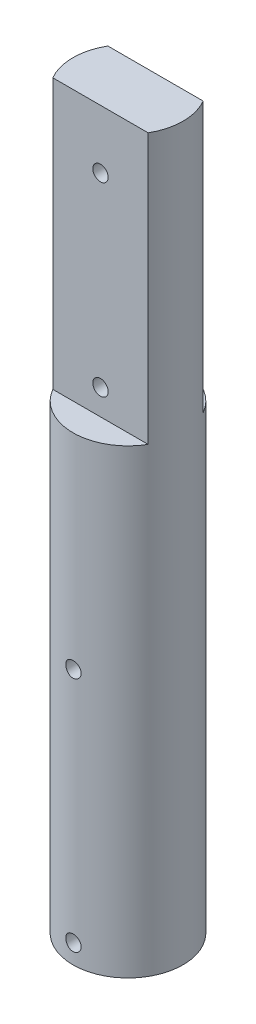
ISO-10303-21;
HEADER;
FILE_DESCRIPTION(('STEP AP214'),'2;1');
FILE_NAME('part.step','',(''),(''),'','','');
FILE_SCHEMA(('AUTOMOTIVE_DESIGN { 1 0 10303 214 1 1 1 1 }'));
ENDSEC;
DATA;
#1=APPLICATION_CONTEXT('core data for automotive mechanical design processes');
#2=APPLICATION_PROTOCOL_DEFINITION('international standard','automotive_design',2000,#1);
#3=PRODUCT_CONTEXT('',#1,'mechanical');
#4=PRODUCT('Part','Part','',(#3));
#5=PRODUCT_RELATED_PRODUCT_CATEGORY('part','',(#4));
#6=PRODUCT_DEFINITION_FORMATION('','',#4);
#7=PRODUCT_DEFINITION_CONTEXT('part definition',#1,'design');
#8=PRODUCT_DEFINITION('design','',#6,#7);
#9=PRODUCT_DEFINITION_SHAPE('','',#8);
#10=(LENGTH_UNIT() NAMED_UNIT(*) SI_UNIT(.MILLI.,.METRE.));
#11=(NAMED_UNIT(*) PLANE_ANGLE_UNIT() SI_UNIT($,.RADIAN.));
#12=(NAMED_UNIT(*) SI_UNIT($,.STERADIAN.) SOLID_ANGLE_UNIT());
#13=UNCERTAINTY_MEASURE_WITH_UNIT(LENGTH_MEASURE(1.E-05),#10,'distance_accuracy_value','');
#14=(GEOMETRIC_REPRESENTATION_CONTEXT(3) GLOBAL_UNCERTAINTY_ASSIGNED_CONTEXT((#13)) GLOBAL_UNIT_ASSIGNED_CONTEXT((#10,
#11,#12)) REPRESENTATION_CONTEXT('',''));
#15=CARTESIAN_POINT('',(0.,0.,0.));
#16=DIRECTION('',(0.,0.,1.));
#17=DIRECTION('',(1.,0.,0.));
#18=AXIS2_PLACEMENT_3D('',#15,#16,#17);
#19=CARTESIAN_POINT('',(0.,57.08,0.));
#20=DIRECTION('',(0.,-1.,0.));
#21=DIRECTION('',(0.,0.,-1.));
#22=AXIS2_PLACEMENT_3D('',#19,#20,#21);
#23=CYLINDRICAL_SURFACE('',#22,4.3);
#24=CARTESIAN_POINT('',(0.,20.6,-4.3));
#25=CARTESIAN_POINT('',(-0.0335275708954897,20.5999985978478,-4.29999948998828));
#26=CARTESIAN_POINT('',(-0.0670752568055947,20.5971802725972,-4.29960374919141));
#27=CARTESIAN_POINT('',(-0.133234765094414,20.5859832404072,-4.29806313788312));
#28=CARTESIAN_POINT('',(-0.165845612787704,20.5775989466993,-4.29691751470318));
#29=CARTESIAN_POINT('',(-0.229164259589988,20.5555238188583,-4.29400602126612));
#30=CARTESIAN_POINT('',(-0.259873409722147,20.5418368032867,-4.29224059742145));
#31=CARTESIAN_POINT('',(-0.318553827917283,20.5095536716102,-4.2882851399914));
#32=CARTESIAN_POINT('',(-0.346525514468045,20.4909583074777,-4.28609517146105));
#33=CARTESIAN_POINT('',(-0.399132362654932,20.4492514408053,-4.28151793661773));
#34=CARTESIAN_POINT('',(-0.423746219246013,20.4261131850964,-4.27912955238765));
#35=CARTESIAN_POINT('',(-0.468755033022216,20.3760348777371,-4.27443353651476));
#36=CARTESIAN_POINT('',(-0.489149760154739,20.349094618913,-4.27212590928101));
#37=CARTESIAN_POINT('',(-0.525222813862831,20.2920358674213,-4.26784178957295));
#38=CARTESIAN_POINT('',(-0.540880803565907,20.2619043998434,-4.26586674063646));
#39=CARTESIAN_POINT('',(-0.566905987390073,20.1994072364682,-4.26248646659039));
#40=CARTESIAN_POINT('',(-0.577273430901677,20.1670416460666,-4.26108121462185));
#41=CARTESIAN_POINT('',(-0.592357659935901,20.1012178549024,-4.25901051645618));
#42=CARTESIAN_POINT('',(-0.597110717131838,20.067768118182,-4.2583403234546));
#43=CARTESIAN_POINT('',(-0.600943561766013,20.000539603382,-4.25780117064252));
#44=CARTESIAN_POINT('',(-0.600023631787931,19.9667608417756,-4.25793217092285));
#45=CARTESIAN_POINT('',(-0.592566315008618,19.9000878341174,-4.25897626031051));
#46=CARTESIAN_POINT('',(-0.58606912945851,19.8671889913896,-4.25988375226073));
#47=CARTESIAN_POINT('',(-0.567704572579319,19.802953093001,-4.26236983738622));
#48=CARTESIAN_POINT('',(-0.555837068176973,19.7716160760626,-4.26394844719133));
#49=CARTESIAN_POINT('',(-0.527026323626944,19.7112699248211,-4.26760515516274));
#50=CARTESIAN_POINT('',(-0.510065861498755,19.6822691193085,-4.2696849432885));
#51=CARTESIAN_POINT('',(-0.471562935270108,19.6275099701351,-4.27410841247884));
#52=CARTESIAN_POINT('',(-0.450020210459266,19.6017518110992,-4.27645210855503));
#53=CARTESIAN_POINT('',(-0.402742670041643,19.5539759864553,-4.28116411843535));
#54=CARTESIAN_POINT('',(-0.376973251465277,19.5319925521903,-4.28353247001617));
#55=CARTESIAN_POINT('',(-0.322092287159643,19.4926575758627,-4.28800807840038));
#56=CARTESIAN_POINT('',(-0.292980730134555,19.4753060494557,-4.29011533432126));
#57=CARTESIAN_POINT('',(-0.232213629625437,19.44572644193,-4.29383310935159));
#58=CARTESIAN_POINT('',(-0.200556892049325,19.4335007825673,-4.29544339356825));
#59=CARTESIAN_POINT('',(-0.135612264376522,19.4145485681921,-4.29798376319159));
#60=CARTESIAN_POINT('',(-0.102324469702198,19.4078216918883,-4.2989138883393));
#61=CARTESIAN_POINT('',(-0.0353583224519229,19.4001030056331,-4.29998392063015));
#62=CARTESIAN_POINT('',(-0.0016854987461861,19.3990640935691,-4.30013031761203));
#63=CARTESIAN_POINT('',(0.0653538297456075,19.4026261202611,-4.2996340014627));
#64=CARTESIAN_POINT('',(0.0987203426804362,19.4072269085437,-4.29899130938524));
#65=CARTESIAN_POINT('',(0.164058846929469,19.4218985824152,-4.29699305017726));
#66=CARTESIAN_POINT('',(0.196036041292867,19.4319467349736,-4.2956404464044));
#67=CARTESIAN_POINT('',(0.257851715539666,19.4572040834507,-4.29237363745077));
#68=CARTESIAN_POINT('',(0.287690106871594,19.4724134929082,-4.29045940903412));
#69=CARTESIAN_POINT('',(0.344589725167919,19.5076736387418,-4.28626620512982));
#70=CARTESIAN_POINT('',(0.37163210723284,19.527754514199,-4.28398498995698));
#71=CARTESIAN_POINT('',(0.421979686070999,19.5721453127426,-4.27931929765121));
#72=CARTESIAN_POINT('',(0.445284696155329,19.5964554469622,-4.27693481536744));
#73=CARTESIAN_POINT('',(0.487665504950374,19.6488234267959,-4.27231099718785));
#74=CARTESIAN_POINT('',(0.506709880716578,19.6769068202911,-4.27007282070155));
#75=CARTESIAN_POINT('',(0.539810994020146,19.7359015084936,-4.26601492837375));
#76=CARTESIAN_POINT('',(0.553867851571848,19.7668127351325,-4.26419520246346));
#77=CARTESIAN_POINT('',(0.576545242128528,19.8304885568759,-4.26118843893877));
#78=CARTESIAN_POINT('',(0.585182829287748,19.8632469806403,-4.25999941837257));
#79=CARTESIAN_POINT('',(0.596831068495092,19.9297671612301,-4.25838324196421));
#80=CARTESIAN_POINT('',(0.599842052660963,19.9635288587164,-4.25795604115468));
#81=CARTESIAN_POINT('',(0.600144507298716,20.0307842941412,-4.25791339524925));
#82=CARTESIAN_POINT('',(0.597485363562369,20.0642778161177,-4.25829094094571));
#83=CARTESIAN_POINT('',(0.58662832621675,20.1303365967041,-4.25980008766519));
#84=CARTESIAN_POINT('',(0.578430436973298,20.1629018560456,-4.26093168809384));
#85=CARTESIAN_POINT('',(0.556745207820723,20.2261691602408,-4.26381911509842));
#86=CARTESIAN_POINT('',(0.543260852083049,20.2568722450073,-4.26557458944993));
#87=CARTESIAN_POINT('',(0.511390326464101,20.3155881392943,-4.26951245715507));
#88=CARTESIAN_POINT('',(0.493004036126813,20.3436008826815,-4.27169486099936));
#89=CARTESIAN_POINT('',(0.4516703997109,20.3963925549525,-4.27626338760595));
#90=CARTESIAN_POINT('',(0.428686359899418,20.4211426233099,-4.27865105496591));
#91=CARTESIAN_POINT('',(0.378886995784174,20.4664525970426,-4.28334785151524));
#92=CARTESIAN_POINT('',(0.352070777188077,20.4870115216311,-4.28565696221616));
#93=CARTESIAN_POINT('',(0.295220169181282,20.5234410796524,-4.28994881478982));
#94=CARTESIAN_POINT('',(0.26517113814944,20.5392890451705,-4.29192995897052));
#95=CARTESIAN_POINT('',(0.202825627356861,20.5656901543197,-4.29532682280706));
#96=CARTESIAN_POINT('',(0.170531567358777,20.5762489010869,-4.29674314048629));
#97=CARTESIAN_POINT('',(0.115068757876271,20.5893179403315,-4.29851944143484));
#98=CARTESIAN_POINT('',(0.0922458092193602,20.5933177536102,-4.29907186458088));
#99=CARTESIAN_POINT('',(0.0462851008623458,20.5986592541178,-4.29981231808903));
#100=CARTESIAN_POINT('',(0.0231473443262198,20.6000009680421,-4.30000035211072));
#101=CARTESIAN_POINT('',(0.,20.6,-4.3));
#102=B_SPLINE_CURVE_WITH_KNOTS('',3,(#24,#25,#26,#27,#28,#29,#30,#31,#32,#33,#34,#35,#36,#37,
#38,#39,#40,#41,#42,#43,#44,#45,#46,#47,#48,#49,#50,#51,#52,#53,#54,#55,#56,#57,#58,#59,#60,#61,
#62,#63,#64,#65,#66,#67,#68,#69,#70,#71,#72,#73,#74,#75,#76,#77,#78,#79,#80,#81,#82,#83,#84,#85,
#86,#87,#88,#89,#90,#91,#92,#93,#94,#95,#96,#97,#98,#99,#100,#101),.UNSPECIFIED.,.T.,.F.,(4,2,2,
2,2,2,2,2,2,2,2,2,2,2,2,2,2,2,2,2,2,2,2,2,2,2,2,2,2,2,2,2,2,2,2,2,2,2,4),(0.,0.100498144631237,
0.201097315798383,0.30162417839486,0.402135648934119,0.50325781806992,0.604385499548968,
0.705941397439209,0.80749250765405,0.908383896114988,1.00927025899966,1.1094354742126,
1.20960317159513,1.31011347802753,1.41062950458006,1.51201376490475,1.61339836789992,
1.71483081701727,1.81625733906144,1.91684266169334,2.01742530065855,2.11759138192519,
2.21776160791049,2.31856812897261,2.41937968394664,2.52091187963721,2.6224416319992,
2.72365025159284,2.82485289702399,2.92517768800756,3.02550239991196,3.12577056060965,
3.22604118543983,3.32714649764197,3.42827544282475,3.5298833975973,3.63138348510181,
3.70076782935699,3.7701514767789),.UNSPECIFIED.);
#103=CARTESIAN_POINT('',(0.,20.6,-4.3));
#104=VERTEX_POINT('',#103);
#105=EDGE_CURVE('E11',#104,#104,#102,.T.);
#106=ORIENTED_EDGE('',*,*,#105,.T.);
#107=EDGE_LOOP('',(#106));
#108=FACE_BOUND('',#107,.T.);
#109=CARTESIAN_POINT('',(0.600000000000002,20.,4.25793377120875));
#110=CARTESIAN_POINT('',(0.599998596295425,19.9664742202909,4.25793430012104));
#111=CARTESIAN_POINT('',(0.597180562007332,19.9329283205578,4.25833401086069));
#112=CARTESIAN_POINT('',(0.585984790455614,19.8667725228749,4.25988879424771));
#113=CARTESIAN_POINT('',(0.577601460026841,19.8341636010267,4.26104462678624));
#114=CARTESIAN_POINT('',(0.555529149502572,19.7708490284595,4.26397824842413));
#115=CARTESIAN_POINT('',(0.541844033576981,19.7401420104136,4.26575558445328));
#116=CARTESIAN_POINT('',(0.509565376901617,19.6814651719407,4.26973141114822));
#117=CARTESIAN_POINT('',(0.490972583540943,19.6534949356181,4.27192983767227));
#118=CARTESIAN_POINT('',(0.449268326315554,19.6008864798205,4.27651721618567));
#119=CARTESIAN_POINT('',(0.426129533826407,19.5762700176842,4.27890726597518));
#120=CARTESIAN_POINT('',(0.376049054908141,19.531256166575,4.28359876394619));
#121=CARTESIAN_POINT('',(0.349107168457573,19.5108589996526,4.28590020745939));
#122=CARTESIAN_POINT('',(0.292046961153537,19.4747833707848,4.29016657082425));
#123=CARTESIAN_POINT('',(0.261915945421763,19.4591248041596,4.29213005727407));
#124=CARTESIAN_POINT('',(0.19941976311111,19.4330984294994,4.29548715382562));
#125=CARTESIAN_POINT('',(0.167054699129085,19.4227303786848,4.29688079007695));
#126=CARTESIAN_POINT('',(0.101232641053802,19.4076449158011,4.29893342127308));
#127=CARTESIAN_POINT('',(0.0677841244297408,19.4028911670605,4.29959713842488));
#128=CARTESIAN_POINT('',(0.000558007541838021,19.3990565164659,4.30013130804566));
#129=CARTESIAN_POINT('',(-0.0332195766999149,19.3999753397828,4.3000017989455));
#130=CARTESIAN_POINT('',(-0.0998974001463257,19.4074308803803,4.29896790198468));
#131=CARTESIAN_POINT('',(-0.132802105181253,19.4139285113459,4.2980689054519));
#132=CARTESIAN_POINT('',(-0.197049497264932,19.4322959817346,4.2956030641155));
#133=CARTESIAN_POINT('',(-0.228392148593683,19.444165943946,4.29403620404744));
#134=CARTESIAN_POINT('',(-0.288745223083573,19.4729818263627,4.29040139870199));
#135=CARTESIAN_POINT('',(-0.317747590654341,19.4899444032253,4.28833181344418));
#136=CARTESIAN_POINT('',(-0.372508971958374,19.5284518693034,4.28392260871992));
#137=CARTESIAN_POINT('',(-0.398267800480896,19.5499970200019,4.28158297384784));
#138=CARTESIAN_POINT('',(-0.446040975382723,19.5972763116646,4.27687148671639));
#139=CARTESIAN_POINT('',(-0.468021577451513,19.6230445527966,4.27449952974786));
#140=CARTESIAN_POINT('',(-0.507351396087956,19.6779221414956,4.27001026095443));
#141=CARTESIAN_POINT('',(-0.524700590924097,19.707031504739,4.26789295032441));
#142=CARTESIAN_POINT('',(-0.554278508405505,19.7677979481793,4.26415276595435));
#143=CARTESIAN_POINT('',(-0.566504100600581,19.7994565718993,4.26253019465761));
#144=CARTESIAN_POINT('',(-0.585455605559508,19.8644053085682,4.25996878377682));
#145=CARTESIAN_POINT('',(-0.592181851445491,19.8976953225662,4.2590299027787));
#146=CARTESIAN_POINT('',(-0.599898153705323,19.9646626006186,4.25794991745381));
#147=CARTESIAN_POINT('',(-0.600935892079845,19.9983342674383,4.25780218185914));
#148=CARTESIAN_POINT('',(-0.597371930882646,20.0653710025916,4.25830363969808));
#149=CARTESIAN_POINT('',(-0.592770382013289,20.0987360790944,4.2589528118354));
#150=CARTESIAN_POINT('',(-0.578098780741736,20.1640669333002,4.26096886684335));
#151=CARTESIAN_POINT('',(-0.568052189581508,20.1960380830949,4.26233266972939));
#152=CARTESIAN_POINT('',(-0.542799981718085,20.2578423565912,4.26562180100149));
#153=CARTESIAN_POINT('',(-0.527594142158212,20.2876753878681,4.26754715364351));
#154=CARTESIAN_POINT('',(-0.492339339686814,20.3445711940587,4.27175818640371));
#155=CARTESIAN_POINT('',(-0.472259333209609,20.3716145619347,4.27404614215043));
#156=CARTESIAN_POINT('',(-0.427869668813238,20.4219645328803,4.27871760884022));
#157=CARTESIAN_POINT('',(-0.403559804823152,20.4452709537862,4.28110112443443));
#158=CARTESIAN_POINT('',(-0.351191243913935,20.4876550404661,4.28571572142422));
#159=CARTESIAN_POINT('',(-0.323106944109375,20.5067012234714,4.28794558878703));
#160=CARTESIAN_POINT('',(-0.264109939406159,20.539805504514,4.29198310160071));
#161=CARTESIAN_POINT('',(-0.233197303202059,20.5538637236586,4.29379075730246));
#162=CARTESIAN_POINT('',(-0.169522186173649,20.5765419670122,4.29677482532511));
#163=CARTESIAN_POINT('',(-0.136766089095656,20.5851796347605,4.29795328375317));
#164=CARTESIAN_POINT('',(-0.0702508340980198,20.5968288227083,4.29955472692375));
#165=CARTESIAN_POINT('',(-0.0364917332478422,20.5998406623888,4.29997775456582));
#166=CARTESIAN_POINT('',(0.0307649940909201,20.6001457063712,4.30002034330506));
#167=CARTESIAN_POINT('',(0.0642624072067575,20.597487243534,4.29964669516435));
#168=CARTESIAN_POINT('',(0.1303291452491,20.5866302032224,4.29815151878314));
#169=CARTESIAN_POINT('',(0.162898472037346,20.5784316368622,4.29702999204301));
#170=CARTESIAN_POINT('',(0.226174268636662,20.5567434169061,4.29416447681792));
#171=CARTESIAN_POINT('',(0.25688174819865,20.5432566614766,4.29242082933027));
#172=CARTESIAN_POINT('',(0.31560543741988,20.5113799689834,4.28850327141806));
#173=CARTESIAN_POINT('',(0.343621583678997,20.4929899164506,4.28632935086119));
#174=CARTESIAN_POINT('',(0.396413325597725,20.4516520299904,4.2817712786857));
#175=CARTESIAN_POINT('',(0.421160735035163,20.4286683697711,4.27938556210956));
#176=CARTESIAN_POINT('',(0.466465520729514,20.3788708739079,4.27468479245348));
#177=CARTESIAN_POINT('',(0.487021909091961,20.3520561377422,4.27236975614315));
#178=CARTESIAN_POINT('',(0.523448604597853,20.2952068464316,4.26806052336625));
#179=CARTESIAN_POINT('',(0.539295821911605,20.2651573793649,4.26606792891221));
#180=CARTESIAN_POINT('',(0.565695413029658,20.2028109684398,4.26264794022746));
#181=CARTESIAN_POINT('',(0.576253398389029,20.1705164480625,4.26121994732925));
#182=CARTESIAN_POINT('',(0.58932038755126,20.1150556546422,4.25942821988946));
#183=CARTESIAN_POINT('',(0.593319279204644,20.0922353254453,4.25887069256528));
#184=CARTESIAN_POINT('',(0.598659556121769,20.0462798583224,4.25812328757004));
#185=CARTESIAN_POINT('',(0.600000969055899,20.0231447236767,4.25793340607097));
#186=CARTESIAN_POINT('',(0.600000000000002,20.,4.25793377120875));
#187=B_SPLINE_CURVE_WITH_KNOTS('',3,(#109,#110,#111,#112,#113,#114,#115,#116,#117,#118,#119,
#120,#121,#122,#123,#124,#125,#126,#127,#128,#129,#130,#131,#132,#133,#134,#135,#136,#137,#138,
#139,#140,#141,#142,#143,#144,#145,#146,#147,#148,#149,#150,#151,#152,#153,#154,#155,#156,#157,
#158,#159,#160,#161,#162,#163,#164,#165,#166,#167,#168,#169,#170,#171,#172,#173,#174,#175,#176,
#177,#178,#179,#180,#181,#182,#183,#184,#185,#186),.UNSPECIFIED.,.T.,.F.,(4,2,2,2,2,2,2,2,2,2,2,
2,2,2,2,2,2,2,2,2,2,2,2,2,2,2,2,2,2,2,2,2,2,2,2,2,2,2,4),(0.,0.100492763153889,
0.201086675510695,0.301607408201596,0.402112841435891,0.50324205466339,0.604376588704395,
0.705930032479188,0.807478815593279,0.908366692649047,1.00924968184822,1.10943157780052,
1.20961576359538,1.3101312640464,1.41065250147672,1.51202949450334,1.61340696320322,
1.71484628214602,1.81627945596097,1.91686108513569,2.01744002646031,2.11758900571794,
2.21774231151875,2.31855104945869,2.41936469999173,2.52090039864442,2.62243363185517,
2.72363464315493,2.82482990724942,2.92516604604304,3.02550198354815,3.12578300911534,
3.22606639643806,3.32716478287199,3.42828697242148,3.52989709562865,3.63139918712562,
3.70077569299435,3.77015147649228),.UNSPECIFIED.);
#188=CARTESIAN_POINT('',(0.600000000000002,20.,4.25793377120875));
#189=VERTEX_POINT('',#188);
#190=EDGE_CURVE('E44',#189,#189,#187,.T.);
#191=ORIENTED_EDGE('',*,*,#190,.T.);
#192=EDGE_LOOP('',(#191));
#193=FACE_BOUND('',#192,.T.);
#194=CARTESIAN_POINT('',(0.,2.09999999999999,-4.3));
#195=CARTESIAN_POINT('',(-0.0335275708954902,2.09999859784776,-4.29999948998828));
#196=CARTESIAN_POINT('',(-0.0670752568055957,2.09718027259714,-4.29960374919141));
#197=CARTESIAN_POINT('',(-0.133234765094415,2.08598324040722,-4.29806313788312));
#198=CARTESIAN_POINT('',(-0.165845612787705,2.07759894669932,-4.29691751470318));
#199=CARTESIAN_POINT('',(-0.229164259589988,2.05552381885833,-4.29400602126612));
#200=CARTESIAN_POINT('',(-0.259873409722147,2.04183680328669,-4.29224059742145));
#201=CARTESIAN_POINT('',(-0.318553827917283,2.00955367161022,-4.2882851399914));
#202=CARTESIAN_POINT('',(-0.346525514468045,1.99095830747764,-4.28609517146105));
#203=CARTESIAN_POINT('',(-0.399132362654933,1.94925144080529,-4.28151793661773));
#204=CARTESIAN_POINT('',(-0.423746219246016,1.92611318509639,-4.27912955238765));
#205=CARTESIAN_POINT('',(-0.468755033022219,1.87603487773707,-4.27443353651476));
#206=CARTESIAN_POINT('',(-0.489149760154741,1.84909461891298,-4.27212590928101));
#207=CARTESIAN_POINT('',(-0.525222813862831,1.79203586742129,-4.26784178957295));
#208=CARTESIAN_POINT('',(-0.540880803565908,1.76190439984341,-4.26586674063646));
#209=CARTESIAN_POINT('',(-0.566905987390074,1.6994072364682,-4.26248646659039));
#210=CARTESIAN_POINT('',(-0.577273430901679,1.66704164606662,-4.26108121462185));
#211=CARTESIAN_POINT('',(-0.592357659935902,1.60121785490242,-4.25901051645618));
#212=CARTESIAN_POINT('',(-0.59711071713184,1.56776811818198,-4.2583403234546));
#213=CARTESIAN_POINT('',(-0.600943561766014,1.500539603382,-4.25780117064252));
#214=CARTESIAN_POINT('',(-0.600023631787933,1.46676084177559,-4.25793217092285));
#215=CARTESIAN_POINT('',(-0.592566315008621,1.40008783411737,-4.25897626031051));
#216=CARTESIAN_POINT('',(-0.586069129458513,1.3671889913896,-4.25988375226073));
#217=CARTESIAN_POINT('',(-0.567704572579322,1.30295309300097,-4.26236983738622));
#218=CARTESIAN_POINT('',(-0.555837068176975,1.27161607606257,-4.26394844719133));
#219=CARTESIAN_POINT('',(-0.527026323626947,1.21126992482106,-4.26760515516274));
#220=CARTESIAN_POINT('',(-0.510065861498758,1.18226911930847,-4.2696849432885));
#221=CARTESIAN_POINT('',(-0.471562935270112,1.12750997013506,-4.27410841247884));
#222=CARTESIAN_POINT('',(-0.450020210459271,1.1017518110992,-4.27645210855503));
#223=CARTESIAN_POINT('',(-0.402742670041647,1.05397598645531,-4.28116411843535));
#224=CARTESIAN_POINT('',(-0.37697325146528,1.03199255219027,-4.28353247001617));
#225=CARTESIAN_POINT('',(-0.322092287159646,0.992657575862646,-4.28800807840038));
#226=CARTESIAN_POINT('',(-0.292980730134558,0.975306049455742,-4.29011533432126));
#227=CARTESIAN_POINT('',(-0.23221362962544,0.94572644192998,-4.29383310935158));
#228=CARTESIAN_POINT('',(-0.200556892049327,0.933500782567258,-4.29544339356825));
#229=CARTESIAN_POINT('',(-0.135612264376524,0.914548568192063,-4.29798376319159));
#230=CARTESIAN_POINT('',(-0.102324469702201,0.907821691888326,-4.2989138883393));
#231=CARTESIAN_POINT('',(-0.0353583224519261,0.900103005633047,-4.29998392063015));
#232=CARTESIAN_POINT('',(-0.00168549874618927,0.899064093569095,-4.30013031761203));
#233=CARTESIAN_POINT('',(0.0653538297456044,0.902626120261055,-4.2996340014627));
#234=CARTESIAN_POINT('',(0.0987203426804331,0.907226908543668,-4.29899130938524));
#235=CARTESIAN_POINT('',(0.164058846929467,0.921898582415187,-4.29699305017726));
#236=CARTESIAN_POINT('',(0.196036041292865,0.931946734973559,-4.2956404464044));
#237=CARTESIAN_POINT('',(0.257851715539664,0.957204083450664,-4.29237363745077));
#238=CARTESIAN_POINT('',(0.287690106871592,0.972413492908244,-4.29045940903412));
#239=CARTESIAN_POINT('',(0.344589725167915,1.00767363874183,-4.28626620512982));
#240=CARTESIAN_POINT('',(0.371632107232836,1.02775451419904,-4.28398498995698));
#241=CARTESIAN_POINT('',(0.421979686070996,1.07214531274262,-4.27931929765121));
#242=CARTESIAN_POINT('',(0.445284696155326,1.09645544696221,-4.27693481536744));
#243=CARTESIAN_POINT('',(0.487665504950372,1.1488234267959,-4.27231099718785));
#244=CARTESIAN_POINT('',(0.506709880716576,1.1769068202911,-4.27007282070155));
#245=CARTESIAN_POINT('',(0.539810994020144,1.23590150849364,-4.26601492837375));
#246=CARTESIAN_POINT('',(0.553867851571846,1.2668127351325,-4.26419520246346));
#247=CARTESIAN_POINT('',(0.576545242128525,1.3304885568759,-4.26118843893877));
#248=CARTESIAN_POINT('',(0.585182829287745,1.36324698064032,-4.25999941837257));
#249=CARTESIAN_POINT('',(0.59683106849509,1.42976716123009,-4.25838324196421));
#250=CARTESIAN_POINT('',(0.599842052660961,1.46352885871636,-4.25795604115468));
#251=CARTESIAN_POINT('',(0.600144507298715,1.53078429414122,-4.25791339524925));
#252=CARTESIAN_POINT('',(0.597485363562367,1.56427781611773,-4.25829094094571));
#253=CARTESIAN_POINT('',(0.586628326216748,1.63033659670407,-4.25980008766519));
#254=CARTESIAN_POINT('',(0.578430436973297,1.66290185604555,-4.26093168809384));
#255=CARTESIAN_POINT('',(0.556745207820721,1.72616916024079,-4.26381911509842));
#256=CARTESIAN_POINT('',(0.543260852083047,1.7568722450073,-4.26557458944993));
#257=CARTESIAN_POINT('',(0.511390326464099,1.81558813929425,-4.26951245715507));
#258=CARTESIAN_POINT('',(0.493004036126811,1.84360088268151,-4.27169486099936));
#259=CARTESIAN_POINT('',(0.451670399710899,1.89639255495253,-4.27626338760595));
#260=CARTESIAN_POINT('',(0.428686359899418,1.92114262330992,-4.27865105496591));
#261=CARTESIAN_POINT('',(0.378886995784175,1.96645259704263,-4.28334785151524));
#262=CARTESIAN_POINT('',(0.352070777188078,1.98701152163108,-4.28565696221616));
#263=CARTESIAN_POINT('',(0.295220169181282,2.02344107965237,-4.28994881478982));
#264=CARTESIAN_POINT('',(0.265171138149441,2.03928904517046,-4.29192995897052));
#265=CARTESIAN_POINT('',(0.202825627356861,2.06569015431973,-4.29532682280706));
#266=CARTESIAN_POINT('',(0.170531567358777,2.07624890108687,-4.29674314048629));
#267=CARTESIAN_POINT('',(0.115068757876271,2.08931794033148,-4.29851944143484));
#268=CARTESIAN_POINT('',(0.0922458092193608,2.0933177536102,-4.29907186458088));
#269=CARTESIAN_POINT('',(0.0462851008623465,2.09865925411781,-4.29981231808903));
#270=CARTESIAN_POINT('',(0.0231473443262201,2.1000009680421,-4.30000035211072));
#271=CARTESIAN_POINT('',(0.,2.09999999999999,-4.3));
#272=B_SPLINE_CURVE_WITH_KNOTS('',3,(#194,#195,#196,#197,#198,#199,#200,#201,#202,#203,#204,
#205,#206,#207,#208,#209,#210,#211,#212,#213,#214,#215,#216,#217,#218,#219,#220,#221,#222,#223,
#224,#225,#226,#227,#228,#229,#230,#231,#232,#233,#234,#235,#236,#237,#238,#239,#240,#241,#242,
#243,#244,#245,#246,#247,#248,#249,#250,#251,#252,#253,#254,#255,#256,#257,#258,#259,#260,#261,
#262,#263,#264,#265,#266,#267,#268,#269,#270,#271),.UNSPECIFIED.,.T.,.F.,(4,2,2,2,2,2,2,2,2,2,2,
2,2,2,2,2,2,2,2,2,2,2,2,2,2,2,2,2,2,2,2,2,2,2,2,2,2,2,4),(0.,0.100498144631238,
0.201097315798383,0.301624178394859,0.402135648934119,0.503257818069923,0.604385499548968,
0.705941397439205,0.807492507654049,0.908383896114985,1.00927025899966,1.10943547421259,
1.20960317159513,1.31011347802753,1.41062950458006,1.51201376490475,1.61339836789992,
1.71483081701727,1.81625733906144,1.91684266169333,2.01742530065855,2.11759138192519,
2.21776160791049,2.31856812897261,2.41937968394664,2.52091187963721,2.6224416319992,
2.72365025159284,2.82485289702399,2.92517768800756,3.02550239991196,3.12577056060965,
3.22604118543983,3.32714649764197,3.42827544282475,3.5298833975973,3.63138348510181,
3.70076782935699,3.7701514767789),.UNSPECIFIED.);
#273=CARTESIAN_POINT('',(0.,2.09999999999999,-4.3));
#274=VERTEX_POINT('',#273);
#275=EDGE_CURVE('E123',#274,#274,#272,.T.);
#276=ORIENTED_EDGE('',*,*,#275,.T.);
#277=EDGE_LOOP('',(#276));
#278=FACE_BOUND('',#277,.T.);
#279=CARTESIAN_POINT('',(0.6,1.5,4.25793377120875));
#280=CARTESIAN_POINT('',(0.599998596295424,1.46647422029086,4.25793430012105));
#281=CARTESIAN_POINT('',(0.59718056200733,1.43292832055775,4.25833401086069));
#282=CARTESIAN_POINT('',(0.585984790455612,1.36677252287489,4.25988879424771));
#283=CARTESIAN_POINT('',(0.57760146002684,1.33416360102667,4.26104462678624));
#284=CARTESIAN_POINT('',(0.55552914950257,1.27084902845948,4.26397824842413));
#285=CARTESIAN_POINT('',(0.541844033576979,1.24014201041361,4.26575558445328));
#286=CARTESIAN_POINT('',(0.509565376901615,1.18146517194072,4.26973141114822));
#287=CARTESIAN_POINT('',(0.490972583540941,1.15349493561809,4.27192983767227));
#288=CARTESIAN_POINT('',(0.449268326315551,1.10088647982053,4.27651721618567));
#289=CARTESIAN_POINT('',(0.426129533826403,1.07627001768419,4.27890726597518));
#290=CARTESIAN_POINT('',(0.376049054908136,1.03125616657496,4.28359876394619));
#291=CARTESIAN_POINT('',(0.349107168457569,1.01085899965257,4.28590020745939));
#292=CARTESIAN_POINT('',(0.292046961153533,0.97478337078475,4.29016657082425));
#293=CARTESIAN_POINT('',(0.261915945421759,0.959124804159624,4.29213005727407));
#294=CARTESIAN_POINT('',(0.199419763111107,0.933098429499353,4.29548715382562));
#295=CARTESIAN_POINT('',(0.167054699129082,0.922730378684835,4.29688079007695));
#296=CARTESIAN_POINT('',(0.101232641053799,0.907644915801123,4.29893342127308));
#297=CARTESIAN_POINT('',(0.0677841244297386,0.902891167060472,4.29959713842488));
#298=CARTESIAN_POINT('',(0.000558007541835466,0.899056516465929,4.30013130804566));
#299=CARTESIAN_POINT('',(-0.0332195766999177,0.899975339782818,4.3000017989455));
#300=CARTESIAN_POINT('',(-0.0998974001463289,0.907430880380319,4.29896790198468));
#301=CARTESIAN_POINT('',(-0.132802105181256,0.913928511345886,4.2980689054519));
#302=CARTESIAN_POINT('',(-0.197049497264935,0.932295981734555,4.2956030641155));
#303=CARTESIAN_POINT('',(-0.228392148593686,0.944165943946025,4.29403620404744));
#304=CARTESIAN_POINT('',(-0.288745223083576,0.972981826362742,4.29040139870199));
#305=CARTESIAN_POINT('',(-0.317747590654344,0.989944403225249,4.28833181344418));
#306=CARTESIAN_POINT('',(-0.372508971958377,1.02845186930344,4.28392260871991));
#307=CARTESIAN_POINT('',(-0.398267800480898,1.04999702000194,4.28158297384784));
#308=CARTESIAN_POINT('',(-0.446040975382726,1.09727631166461,4.27687148671639));
#309=CARTESIAN_POINT('',(-0.468021577451516,1.12304455279656,4.27449952974786));
#310=CARTESIAN_POINT('',(-0.507351396087959,1.1779221414956,4.27001026095443));
#311=CARTESIAN_POINT('',(-0.5247005909241,1.20703150473901,4.26789295032441));
#312=CARTESIAN_POINT('',(-0.554278508405508,1.26779794817925,4.26415276595435));
#313=CARTESIAN_POINT('',(-0.566504100600583,1.29945657189932,4.26253019465761));
#314=CARTESIAN_POINT('',(-0.58545560555951,1.36440530856817,4.25996878377682));
#315=CARTESIAN_POINT('',(-0.592181851445492,1.3976953225662,4.2590299027787));
#316=CARTESIAN_POINT('',(-0.599898153705324,1.46466260061861,4.25794991745381));
#317=CARTESIAN_POINT('',(-0.600935892079846,1.49833426743828,4.25780218185914));
#318=CARTESIAN_POINT('',(-0.597371930882647,1.56537100259158,4.25830363969808));
#319=CARTESIAN_POINT('',(-0.592770382013291,1.59873607909441,4.2589528118354));
#320=CARTESIAN_POINT('',(-0.578098780741738,1.6640669333002,4.26096886684335));
#321=CARTESIAN_POINT('',(-0.56805218958151,1.69603808309493,4.26233266972939));
#322=CARTESIAN_POINT('',(-0.542799981718087,1.75784235659122,4.26562180100149));
#323=CARTESIAN_POINT('',(-0.527594142158214,1.7876753878681,4.26754715364351));
#324=CARTESIAN_POINT('',(-0.492339339686817,1.84457119405871,4.27175818640371));
#325=CARTESIAN_POINT('',(-0.472259333209612,1.87161456193474,4.27404614215043));
#326=CARTESIAN_POINT('',(-0.42786966881324,1.92196453288025,4.27871760884022));
#327=CARTESIAN_POINT('',(-0.403559804823154,1.94527095378616,4.28110112443443));
#328=CARTESIAN_POINT('',(-0.351191243913936,1.98765504046612,4.28571572142422));
#329=CARTESIAN_POINT('',(-0.323106944109376,2.00670122347136,4.28794558878703));
#330=CARTESIAN_POINT('',(-0.26410993940616,2.03980550451403,4.29198310160071));
#331=CARTESIAN_POINT('',(-0.23319730320206,2.05386372365854,4.29379075730246));
#332=CARTESIAN_POINT('',(-0.169522186173649,2.07654196701224,4.29677482532511));
#333=CARTESIAN_POINT('',(-0.136766089095656,2.08517963476051,4.29795328375316));
#334=CARTESIAN_POINT('',(-0.0702508340980209,2.09682882270824,4.29955472692375));
#335=CARTESIAN_POINT('',(-0.0364917332478431,2.09984066238877,4.29997775456582));
#336=CARTESIAN_POINT('',(0.0307649940909195,2.10014570637115,4.30002034330506));
#337=CARTESIAN_POINT('',(0.0642624072067569,2.09748724353404,4.29964669516435));
#338=CARTESIAN_POINT('',(0.130329145249099,2.08663020322243,4.29815151878314));
#339=CARTESIAN_POINT('',(0.162898472037345,2.0784316368622,4.29702999204301));
#340=CARTESIAN_POINT('',(0.226174268636661,2.05674341690608,4.29416447681792));
#341=CARTESIAN_POINT('',(0.256881748198649,2.04325666147655,4.29242082933027));
#342=CARTESIAN_POINT('',(0.315605437419879,2.01137996898339,4.28850327141806));
#343=CARTESIAN_POINT('',(0.343621583678996,1.99298991645059,4.28632935086119));
#344=CARTESIAN_POINT('',(0.396413325597723,1.95165202999039,4.2817712786857));
#345=CARTESIAN_POINT('',(0.421160735035161,1.92866836977108,4.27938556210956));
#346=CARTESIAN_POINT('',(0.466465520729513,1.87887087390787,4.27468479245348));
#347=CARTESIAN_POINT('',(0.48702190909196,1.85205613774218,4.27236975614315));
#348=CARTESIAN_POINT('',(0.523448604597853,1.7952068464316,4.26806052336625));
#349=CARTESIAN_POINT('',(0.539295821911604,1.76515737936488,4.26606792891221));
#350=CARTESIAN_POINT('',(0.565695413029657,1.70281096843975,4.26264794022746));
#351=CARTESIAN_POINT('',(0.576253398389029,1.67051644806249,4.26121994732925));
#352=CARTESIAN_POINT('',(0.589320387551259,1.61505565464218,4.25942821988946));
#353=CARTESIAN_POINT('',(0.593319279204643,1.59223532544531,4.25887069256528));
#354=CARTESIAN_POINT('',(0.598659556121768,1.54627985832237,4.25812328757004));
#355=CARTESIAN_POINT('',(0.600000969055897,1.52314472367666,4.25793340607097));
#356=CARTESIAN_POINT('',(0.6,1.5,4.25793377120875));
#357=B_SPLINE_CURVE_WITH_KNOTS('',3,(#279,#280,#281,#282,#283,#284,#285,#286,#287,#288,#289,
#290,#291,#292,#293,#294,#295,#296,#297,#298,#299,#300,#301,#302,#303,#304,#305,#306,#307,#308,
#309,#310,#311,#312,#313,#314,#315,#316,#317,#318,#319,#320,#321,#322,#323,#324,#325,#326,#327,
#328,#329,#330,#331,#332,#333,#334,#335,#336,#337,#338,#339,#340,#341,#342,#343,#344,#345,#346,
#347,#348,#349,#350,#351,#352,#353,#354,#355,#356),.UNSPECIFIED.,.T.,.F.,(4,2,2,2,2,2,2,2,2,2,2,
2,2,2,2,2,2,2,2,2,2,2,2,2,2,2,2,2,2,2,2,2,2,2,2,2,2,2,4),(0.,0.100492763153889,
0.201086675510695,0.301607408201596,0.402112841435892,0.503242054663393,0.604376588704398,
0.705930032479189,0.807478815593278,0.908366692649047,1.00924968184822,1.10943157780052,
1.20961576359538,1.3101312640464,1.41065250147672,1.51202949450334,1.61340696320322,
1.71484628214602,1.81627945596097,1.91686108513569,2.01744002646031,2.11758900571793,
2.21774231151875,2.31855104945869,2.41936469999173,2.52090039864442,2.62243363185517,
2.72363464315493,2.82482990724942,2.92516604604304,3.02550198354815,3.12578300911534,
3.22606639643806,3.32716478287199,3.42828697242149,3.52989709562866,3.63139918712562,
3.70077569299435,3.77015147649228),.UNSPECIFIED.);
#358=CARTESIAN_POINT('',(0.6,1.5,4.25793377120875));
#359=VERTEX_POINT('',#358);
#360=EDGE_CURVE('E114',#359,#359,#357,.T.);
#361=ORIENTED_EDGE('',*,*,#360,.T.);
#362=EDGE_LOOP('',(#361));
#363=FACE_BOUND('',#362,.T.);
#364=CARTESIAN_POINT('',(0.,57.08,0.));
#365=DIRECTION('',(0.,1.,0.));
#366=DIRECTION('',(0.,0.,1.));
#367=AXIS2_PLACEMENT_3D('',#364,#365,#366);
#368=CIRCLE('',#367,4.3);
#369=CARTESIAN_POINT('',(3.72390923627309,57.08,2.15));
#370=VERTEX_POINT('',#369);
#371=CARTESIAN_POINT('',(3.72390923627308,57.08,-2.15));
#372=VERTEX_POINT('',#371);
#373=EDGE_CURVE('E115',#370,#372,#368,.T.);
#374=ORIENTED_EDGE('',*,*,#373,.F.);
#375=DIRECTION('',(0.,1.,0.));
#376=VECTOR('',#375,1.);
#377=CARTESIAN_POINT('',(3.72390923627308,36.,2.15));
#378=LINE('',#377,#376);
#379=CARTESIAN_POINT('',(3.72390923627308,36.,2.15));
#380=VERTEX_POINT('',#379);
#381=EDGE_CURVE('E51',#380,#370,#378,.T.);
#382=ORIENTED_EDGE('',*,*,#381,.F.);
#383=CARTESIAN_POINT('',(0.,36.,0.));
#384=DIRECTION('',(0.,1.,0.));
#385=DIRECTION('',(0.,0.,1.));
#386=AXIS2_PLACEMENT_3D('',#383,#384,#385);
#387=CIRCLE('',#386,4.3);
#388=CARTESIAN_POINT('',(-3.72390923627308,36.,2.15));
#389=VERTEX_POINT('',#388);
#390=EDGE_CURVE('E81',#389,#380,#387,.T.);
#391=ORIENTED_EDGE('',*,*,#390,.F.);
#392=DIRECTION('',(0.,1.,0.));
#393=VECTOR('',#392,1.);
#394=CARTESIAN_POINT('',(-3.72390923627308,36.,2.15));
#395=LINE('',#394,#393);
#396=CARTESIAN_POINT('',(-3.72390923627308,57.08,2.15));
#397=VERTEX_POINT('',#396);
#398=EDGE_CURVE('E85',#389,#397,#395,.T.);
#399=ORIENTED_EDGE('',*,*,#398,.T.);
#400=CARTESIAN_POINT('',(-3.72390923627309,57.08,-2.15));
#401=VERTEX_POINT('',#400);
#402=EDGE_CURVE('E112',#401,#397,#368,.T.);
#403=ORIENTED_EDGE('',*,*,#402,.F.);
#404=DIRECTION('',(0.,1.,0.));
#405=VECTOR('',#404,1.);
#406=CARTESIAN_POINT('',(-3.72390923627308,36.,-2.15));
#407=LINE('',#406,#405);
#408=CARTESIAN_POINT('',(-3.72390923627308,36.,-2.15));
#409=VERTEX_POINT('',#408);
#410=EDGE_CURVE('E59',#409,#401,#407,.T.);
#411=ORIENTED_EDGE('',*,*,#410,.F.);
#412=CARTESIAN_POINT('',(0.,36.,0.));
#413=DIRECTION('',(0.,1.,0.));
#414=DIRECTION('',(0.,0.,-1.));
#415=AXIS2_PLACEMENT_3D('',#412,#413,#414);
#416=CIRCLE('',#415,4.3);
#417=CARTESIAN_POINT('',(3.72390923627308,36.,-2.15));
#418=VERTEX_POINT('',#417);
#419=EDGE_CURVE('E103',#418,#409,#416,.T.);
#420=ORIENTED_EDGE('',*,*,#419,.F.);
#421=DIRECTION('',(0.,1.,0.));
#422=VECTOR('',#421,1.);
#423=CARTESIAN_POINT('',(3.72390923627308,36.,-2.15));
#424=LINE('',#423,#422);
#425=EDGE_CURVE('E106',#418,#372,#424,.T.);
#426=ORIENTED_EDGE('',*,*,#425,.T.);
#427=EDGE_LOOP('',(#374,#382,#391,#399,#403,#411,#420,#426));
#428=FACE_BOUND('',#427,.T.);
#429=CARTESIAN_POINT('',(0.,0.,0.));
#430=DIRECTION('',(0.,1.,0.));
#431=DIRECTION('',(0.,0.,1.));
#432=AXIS2_PLACEMENT_3D('',#429,#430,#431);
#433=CIRCLE('',#432,4.3);
#434=CARTESIAN_POINT('',(0.,0.,4.3));
#435=VERTEX_POINT('',#434);
#436=EDGE_CURVE('E109',#435,#435,#433,.T.);
#437=ORIENTED_EDGE('',*,*,#436,.T.);
#438=EDGE_LOOP('',(#437));
#439=FACE_BOUND('',#438,.T.);
#440=ADVANCED_FACE('F33',(#108,#193,#278,#363,#428,#439),#23,.T.);
#441=CARTESIAN_POINT('',(0.,57.08,0.));
#442=DIRECTION('',(0.,1.,0.));
#443=DIRECTION('',(0.,0.,1.));
#444=AXIS2_PLACEMENT_3D('',#441,#442,#443);
#445=PLANE('',#444);
#446=DIRECTION('',(-1.,0.,0.));
#447=VECTOR('',#446,1.);
#448=CARTESIAN_POINT('',(0.,57.08,2.15));
#449=LINE('',#448,#447);
#450=EDGE_CURVE('E82',#370,#397,#449,.T.);
#451=ORIENTED_EDGE('',*,*,#450,.F.);
#452=ORIENTED_EDGE('',*,*,#373,.T.);
#453=DIRECTION('',(1.,0.,0.));
#454=VECTOR('',#453,1.);
#455=CARTESIAN_POINT('',(0.,57.08,-2.15));
#456=LINE('',#455,#454);
#457=EDGE_CURVE('E98',#401,#372,#456,.T.);
#458=ORIENTED_EDGE('',*,*,#457,.F.);
#459=ORIENTED_EDGE('',*,*,#402,.T.);
#460=EDGE_LOOP('',(#451,#452,#458,#459));
#461=FACE_BOUND('',#460,.T.);
#462=ADVANCED_FACE('F148',(#461),#445,.T.);
#463=CARTESIAN_POINT('',(0.,0.,0.));
#464=DIRECTION('',(0.,1.,0.));
#465=DIRECTION('',(0.,0.,1.));
#466=AXIS2_PLACEMENT_3D('',#463,#464,#465);
#467=PLANE('',#466);
#468=ORIENTED_EDGE('',*,*,#436,.F.);
#469=EDGE_LOOP('',(#468));
#470=FACE_BOUND('',#469,.T.);
#471=ADVANCED_FACE('F146',(#470),#467,.F.);
#472=CARTESIAN_POINT('',(0.,36.,-2.15));
#473=DIRECTION('',(0.,0.,1.));
#474=DIRECTION('',(1.,0.,0.));
#475=AXIS2_PLACEMENT_3D('',#472,#473,#474);
#476=PLANE('',#475);
#477=CARTESIAN_POINT('',(0.,52.5,-2.15));
#478=DIRECTION('',(0.,0.,1.));
#479=DIRECTION('',(1.,0.,0.));
#480=AXIS2_PLACEMENT_3D('',#477,#478,#479);
#481=CIRCLE('',#480,0.600000000000003);
#482=CARTESIAN_POINT('',(0.600000000000002,52.5,-2.15));
#483=VERTEX_POINT('',#482);
#484=EDGE_CURVE('E189',#483,#483,#481,.T.);
#485=ORIENTED_EDGE('',*,*,#484,.T.);
#486=EDGE_LOOP('',(#485));
#487=FACE_BOUND('',#486,.T.);
#488=CARTESIAN_POINT('',(0.,38.,-2.15));
#489=DIRECTION('',(0.,0.,1.));
#490=DIRECTION('',(1.,0.,0.));
#491=AXIS2_PLACEMENT_3D('',#488,#489,#490);
#492=CIRCLE('',#491,0.600000000000003);
#493=CARTESIAN_POINT('',(0.600000000000002,38.,-2.15));
#494=VERTEX_POINT('',#493);
#495=EDGE_CURVE('E97',#494,#494,#492,.T.);
#496=ORIENTED_EDGE('',*,*,#495,.T.);
#497=EDGE_LOOP('',(#496));
#498=FACE_BOUND('',#497,.T.);
#499=ORIENTED_EDGE('',*,*,#457,.T.);
#500=ORIENTED_EDGE('',*,*,#425,.F.);
#501=DIRECTION('',(1.,0.,0.));
#502=VECTOR('',#501,1.);
#503=CARTESIAN_POINT('',(0.,36.,-2.15));
#504=LINE('',#503,#502);
#505=EDGE_CURVE('E100',#409,#418,#504,.T.);
#506=ORIENTED_EDGE('',*,*,#505,.F.);
#507=ORIENTED_EDGE('',*,*,#410,.T.);
#508=EDGE_LOOP('',(#499,#500,#506,#507));
#509=FACE_BOUND('',#508,.T.);
#510=ADVANCED_FACE('F142',(#487,#498,#509),#476,.F.);
#511=CARTESIAN_POINT('',(0.,36.,0.));
#512=DIRECTION('',(0.,-1.,0.));
#513=DIRECTION('',(0.,0.,-1.));
#514=AXIS2_PLACEMENT_3D('',#511,#512,#513);
#515=PLANE('',#514);
#516=ORIENTED_EDGE('',*,*,#505,.T.);
#517=ORIENTED_EDGE('',*,*,#419,.T.);
#518=EDGE_LOOP('',(#516,#517));
#519=FACE_BOUND('',#518,.T.);
#520=ADVANCED_FACE('F138',(#519),#515,.F.);
#521=CARTESIAN_POINT('',(0.,36.,2.15));
#522=DIRECTION('',(0.,0.,-1.));
#523=DIRECTION('',(-1.,0.,0.));
#524=AXIS2_PLACEMENT_3D('',#521,#522,#523);
#525=PLANE('',#524);
#526=CARTESIAN_POINT('',(0.,52.5,2.15));
#527=DIRECTION('',(0.,0.,1.));
#528=DIRECTION('',(1.,0.,0.));
#529=AXIS2_PLACEMENT_3D('',#526,#527,#528);
#530=CIRCLE('',#529,0.600000000000003);
#531=CARTESIAN_POINT('',(0.600000000000002,52.5,2.15));
#532=VERTEX_POINT('',#531);
#533=EDGE_CURVE('E186',#532,#532,#530,.T.);
#534=ORIENTED_EDGE('',*,*,#533,.F.);
#535=EDGE_LOOP('',(#534));
#536=FACE_BOUND('',#535,.T.);
#537=CARTESIAN_POINT('',(0.,38.,2.15));
#538=DIRECTION('',(0.,0.,1.));
#539=DIRECTION('',(1.,0.,0.));
#540=AXIS2_PLACEMENT_3D('',#537,#538,#539);
#541=CIRCLE('',#540,0.600000000000003);
#542=CARTESIAN_POINT('',(0.600000000000002,38.,2.15));
#543=VERTEX_POINT('',#542);
#544=EDGE_CURVE('E190',#543,#543,#541,.T.);
#545=ORIENTED_EDGE('',*,*,#544,.F.);
#546=EDGE_LOOP('',(#545));
#547=FACE_BOUND('',#546,.T.);
#548=ORIENTED_EDGE('',*,*,#450,.T.);
#549=ORIENTED_EDGE('',*,*,#398,.F.);
#550=DIRECTION('',(-1.,0.,0.));
#551=VECTOR('',#550,1.);
#552=CARTESIAN_POINT('',(0.,36.,2.15));
#553=LINE('',#552,#551);
#554=EDGE_CURVE('E77',#380,#389,#553,.T.);
#555=ORIENTED_EDGE('',*,*,#554,.F.);
#556=ORIENTED_EDGE('',*,*,#381,.T.);
#557=EDGE_LOOP('',(#548,#549,#555,#556));
#558=FACE_BOUND('',#557,.T.);
#559=ADVANCED_FACE('F86',(#536,#547,#558),#525,.F.);
#560=CARTESIAN_POINT('',(0.,36.,0.));
#561=DIRECTION('',(0.,1.,0.));
#562=DIRECTION('',(0.,0.,1.));
#563=AXIS2_PLACEMENT_3D('',#560,#561,#562);
#564=PLANE('',#563);
#565=ORIENTED_EDGE('',*,*,#554,.T.);
#566=ORIENTED_EDGE('',*,*,#390,.T.);
#567=EDGE_LOOP('',(#565,#566));
#568=FACE_BOUND('',#567,.T.);
#569=ADVANCED_FACE('F79',(#568),#564,.T.);
#570=CARTESIAN_POINT('',(0.,1.5,-4.3));
#571=DIRECTION('',(0.,0.,1.));
#572=DIRECTION('',(1.,0.,0.));
#573=AXIS2_PLACEMENT_3D('',#570,#571,#572);
#574=CYLINDRICAL_SURFACE('',#573,0.6);
#575=ORIENTED_EDGE('',*,*,#360,.F.);
#576=EDGE_LOOP('',(#575));
#577=FACE_BOUND('',#576,.T.);
#578=ORIENTED_EDGE('',*,*,#275,.F.);
#579=EDGE_LOOP('',(#578));
#580=FACE_BOUND('',#579,.T.);
#581=ADVANCED_FACE('F126',(#577,#580),#574,.F.);
#582=CARTESIAN_POINT('',(0.,38.,-7.85));
#583=DIRECTION('',(0.,0.,1.));
#584=DIRECTION('',(1.,0.,0.));
#585=AXIS2_PLACEMENT_3D('',#582,#583,#584);
#586=CYLINDRICAL_SURFACE('',#585,0.600000000000003);
#587=ORIENTED_EDGE('',*,*,#544,.T.);
#588=EDGE_LOOP('',(#587));
#589=FACE_BOUND('',#588,.T.);
#590=ORIENTED_EDGE('',*,*,#495,.F.);
#591=EDGE_LOOP('',(#590));
#592=FACE_BOUND('',#591,.T.);
#593=ADVANCED_FACE('F131',(#589,#592),#586,.F.);
#594=CARTESIAN_POINT('',(0.,20.,-4.3));
#595=DIRECTION('',(0.,0.,1.));
#596=DIRECTION('',(1.,0.,0.));
#597=AXIS2_PLACEMENT_3D('',#594,#595,#596);
#598=CYLINDRICAL_SURFACE('',#597,0.6);
#599=ORIENTED_EDGE('',*,*,#190,.F.);
#600=EDGE_LOOP('',(#599));
#601=FACE_BOUND('',#600,.T.);
#602=ORIENTED_EDGE('',*,*,#105,.F.);
#603=EDGE_LOOP('',(#602));
#604=FACE_BOUND('',#603,.T.);
#605=ADVANCED_FACE('F172',(#601,#604),#598,.F.);
#606=CARTESIAN_POINT('',(0.,52.5,-4.3));
#607=DIRECTION('',(0.,0.,1.));
#608=DIRECTION('',(1.,0.,0.));
#609=AXIS2_PLACEMENT_3D('',#606,#607,#608);
#610=CYLINDRICAL_SURFACE('',#609,0.600000000000003);
#611=ORIENTED_EDGE('',*,*,#533,.T.);
#612=EDGE_LOOP('',(#611));
#613=FACE_BOUND('',#612,.T.);
#614=ORIENTED_EDGE('',*,*,#484,.F.);
#615=EDGE_LOOP('',(#614));
#616=FACE_BOUND('',#615,.T.);
#617=ADVANCED_FACE('F176',(#613,#616),#610,.F.);
#618=CLOSED_SHELL('',(#440,#462,#471,#510,#520,#559,#569,#581,#593,#605,#617));
#619=MANIFOLD_SOLID_BREP('B2',#618);
#620=ADVANCED_BREP_SHAPE_REPRESENTATION('',(#18,#619),#14);
#621=SHAPE_DEFINITION_REPRESENTATION(#9,#620);
ENDSEC;
END-ISO-10303-21;
